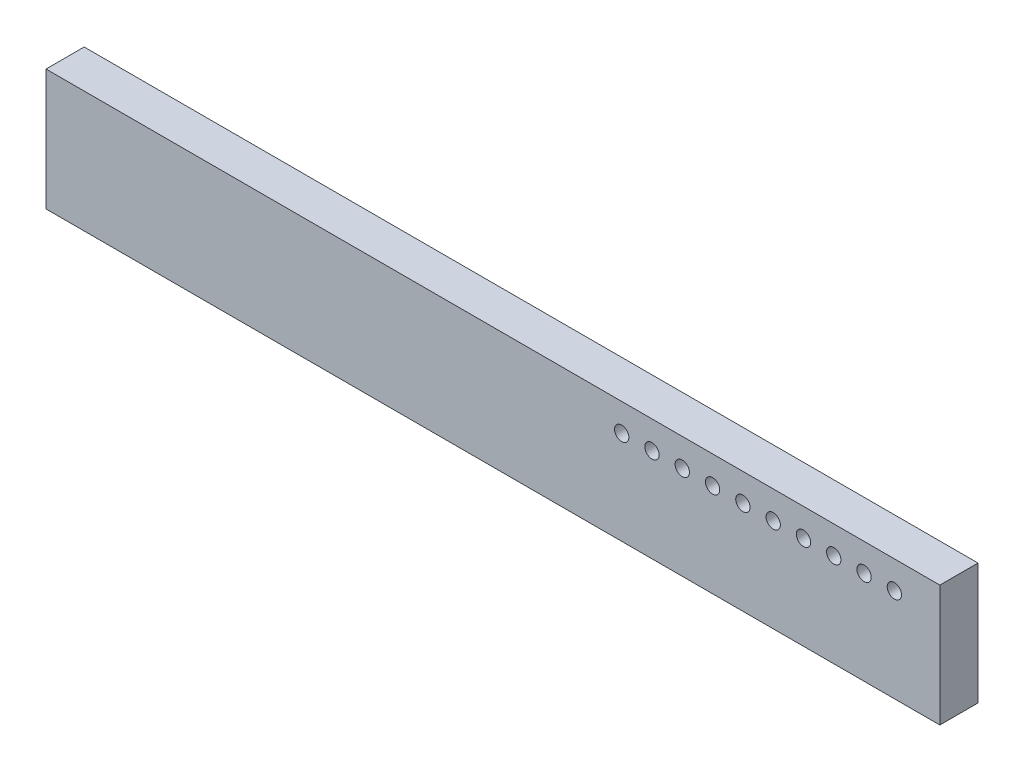
ISO-10303-21;
HEADER;
FILE_DESCRIPTION(('STEP AP214'),'2;1');
FILE_NAME('part.step','',(''),(''),'','','');
FILE_SCHEMA(('AUTOMOTIVE_DESIGN { 1 0 10303 214 1 1 1 1 }'));
ENDSEC;
DATA;
#1=APPLICATION_CONTEXT('core data for automotive mechanical design processes');
#2=APPLICATION_PROTOCOL_DEFINITION('international standard','automotive_design',2000,#1);
#3=PRODUCT_CONTEXT('',#1,'mechanical');
#4=PRODUCT('Part','Part','',(#3));
#5=PRODUCT_RELATED_PRODUCT_CATEGORY('part','',(#4));
#6=PRODUCT_DEFINITION_FORMATION('','',#4);
#7=PRODUCT_DEFINITION_CONTEXT('part definition',#1,'design');
#8=PRODUCT_DEFINITION('design','',#6,#7);
#9=PRODUCT_DEFINITION_SHAPE('','',#8);
#10=(LENGTH_UNIT() NAMED_UNIT(*) SI_UNIT(.MILLI.,.METRE.));
#11=(NAMED_UNIT(*) PLANE_ANGLE_UNIT() SI_UNIT($,.RADIAN.));
#12=(NAMED_UNIT(*) SI_UNIT($,.STERADIAN.) SOLID_ANGLE_UNIT());
#13=UNCERTAINTY_MEASURE_WITH_UNIT(LENGTH_MEASURE(1.E-05),#10,'distance_accuracy_value','');
#14=(GEOMETRIC_REPRESENTATION_CONTEXT(3) GLOBAL_UNCERTAINTY_ASSIGNED_CONTEXT((#13)) GLOBAL_UNIT_ASSIGNED_CONTEXT((#10,
#11,#12)) REPRESENTATION_CONTEXT('',''));
#15=CARTESIAN_POINT('',(0.,0.,0.));
#16=DIRECTION('',(0.,0.,1.));
#17=DIRECTION('',(1.,0.,0.));
#18=AXIS2_PLACEMENT_3D('',#15,#16,#17);
#19=CARTESIAN_POINT('',(-18.7325,2.54,1.6));
#20=DIRECTION('',(0.,1.,0.));
#21=DIRECTION('',(0.,0.,1.));
#22=AXIS2_PLACEMENT_3D('',#19,#20,#21);
#23=PLANE('',#22);
#24=DIRECTION('',(1.,0.,0.));
#25=VECTOR('',#24,1.);
#26=CARTESIAN_POINT('',(-18.7325,2.54,0.));
#27=LINE('',#26,#25);
#28=CARTESIAN_POINT('',(-18.7325,2.54,0.));
#29=VERTEX_POINT('',#28);
#30=CARTESIAN_POINT('',(18.7325,2.54,0.));
#31=VERTEX_POINT('',#30);
#32=EDGE_CURVE('E86',#29,#31,#27,.T.);
#33=ORIENTED_EDGE('',*,*,#32,.F.);
#34=DIRECTION('',(0.,0.,-1.));
#35=VECTOR('',#34,1.);
#36=CARTESIAN_POINT('',(-18.7325,2.54,1.6));
#37=LINE('',#36,#35);
#38=CARTESIAN_POINT('',(-18.7325,2.54,1.6));
#39=VERTEX_POINT('',#38);
#40=EDGE_CURVE('E75',#39,#29,#37,.T.);
#41=ORIENTED_EDGE('',*,*,#40,.F.);
#42=DIRECTION('',(1.,0.,0.));
#43=VECTOR('',#42,1.);
#44=CARTESIAN_POINT('',(-18.7325,2.54,1.6));
#45=LINE('',#44,#43);
#46=CARTESIAN_POINT('',(18.7325,2.54,1.6));
#47=VERTEX_POINT('',#46);
#48=EDGE_CURVE('E110',#39,#47,#45,.T.);
#49=ORIENTED_EDGE('',*,*,#48,.T.);
#50=DIRECTION('',(0.,0.,-1.));
#51=VECTOR('',#50,1.);
#52=CARTESIAN_POINT('',(18.7325,2.54,1.6));
#53=LINE('',#52,#51);
#54=EDGE_CURVE('E87',#47,#31,#53,.T.);
#55=ORIENTED_EDGE('',*,*,#54,.T.);
#56=EDGE_LOOP('',(#33,#41,#49,#55));
#57=FACE_BOUND('',#56,.T.);
#58=ADVANCED_FACE('F32',(#57),#23,.T.);
#59=CARTESIAN_POINT('',(-18.7325,-2.54,1.6));
#60=DIRECTION('',(-1.,0.,0.));
#61=DIRECTION('',(0.,0.,1.));
#62=AXIS2_PLACEMENT_3D('',#59,#60,#61);
#63=PLANE('',#62);
#64=DIRECTION('',(0.,1.,0.));
#65=VECTOR('',#64,1.);
#66=CARTESIAN_POINT('',(-18.7325,-2.54,0.));
#67=LINE('',#66,#65);
#68=CARTESIAN_POINT('',(-18.7325,-2.54,0.));
#69=VERTEX_POINT('',#68);
#70=EDGE_CURVE('E79',#69,#29,#67,.T.);
#71=ORIENTED_EDGE('',*,*,#70,.F.);
#72=DIRECTION('',(0.,0.,-1.));
#73=VECTOR('',#72,1.);
#74=CARTESIAN_POINT('',(-18.7325,-2.54,1.6));
#75=LINE('',#74,#73);
#76=CARTESIAN_POINT('',(-18.7325,-2.54,1.6));
#77=VERTEX_POINT('',#76);
#78=EDGE_CURVE('E103',#77,#69,#75,.T.);
#79=ORIENTED_EDGE('',*,*,#78,.F.);
#80=DIRECTION('',(0.,1.,0.));
#81=VECTOR('',#80,1.);
#82=CARTESIAN_POINT('',(-18.7325,-2.54,1.6));
#83=LINE('',#82,#81);
#84=EDGE_CURVE('E80',#77,#39,#83,.T.);
#85=ORIENTED_EDGE('',*,*,#84,.T.);
#86=ORIENTED_EDGE('',*,*,#40,.T.);
#87=EDGE_LOOP('',(#71,#79,#85,#86));
#88=FACE_BOUND('',#87,.T.);
#89=ADVANCED_FACE('F77',(#88),#63,.T.);
#90=CARTESIAN_POINT('',(-18.7325,-2.54,1.6));
#91=DIRECTION('',(0.,1.,0.));
#92=DIRECTION('',(0.,0.,1.));
#93=AXIS2_PLACEMENT_3D('',#90,#91,#92);
#94=PLANE('',#93);
#95=DIRECTION('',(1.,0.,0.));
#96=VECTOR('',#95,1.);
#97=CARTESIAN_POINT('',(-18.7325,-2.54,0.));
#98=LINE('',#97,#96);
#99=CARTESIAN_POINT('',(18.7325,-2.54,0.));
#100=VERTEX_POINT('',#99);
#101=EDGE_CURVE('E83',#69,#100,#98,.T.);
#102=ORIENTED_EDGE('',*,*,#101,.T.);
#103=DIRECTION('',(0.,0.,-1.));
#104=VECTOR('',#103,1.);
#105=CARTESIAN_POINT('',(18.7325,-2.54,1.6));
#106=LINE('',#105,#104);
#107=CARTESIAN_POINT('',(18.7325,-2.54,1.6));
#108=VERTEX_POINT('',#107);
#109=EDGE_CURVE('E105',#108,#100,#106,.T.);
#110=ORIENTED_EDGE('',*,*,#109,.F.);
#111=DIRECTION('',(1.,0.,0.));
#112=VECTOR('',#111,1.);
#113=CARTESIAN_POINT('',(-18.7325,-2.54,1.6));
#114=LINE('',#113,#112);
#115=EDGE_CURVE('E53',#77,#108,#114,.T.);
#116=ORIENTED_EDGE('',*,*,#115,.F.);
#117=ORIENTED_EDGE('',*,*,#78,.T.);
#118=EDGE_LOOP('',(#102,#110,#116,#117));
#119=FACE_BOUND('',#118,.T.);
#120=ADVANCED_FACE('F212',(#119),#94,.F.);
#121=CARTESIAN_POINT('',(18.7325,-2.54,1.6));
#122=DIRECTION('',(-1.,0.,0.));
#123=DIRECTION('',(0.,0.,1.));
#124=AXIS2_PLACEMENT_3D('',#121,#122,#123);
#125=PLANE('',#124);
#126=DIRECTION('',(0.,1.,0.));
#127=VECTOR('',#126,1.);
#128=CARTESIAN_POINT('',(18.7325,-2.54,0.));
#129=LINE('',#128,#127);
#130=EDGE_CURVE('E104',#100,#31,#129,.T.);
#131=ORIENTED_EDGE('',*,*,#130,.T.);
#132=ORIENTED_EDGE('',*,*,#54,.F.);
#133=DIRECTION('',(0.,1.,0.));
#134=VECTOR('',#133,1.);
#135=CARTESIAN_POINT('',(18.7325,-2.54,1.6));
#136=LINE('',#135,#134);
#137=EDGE_CURVE('E48',#108,#47,#136,.T.);
#138=ORIENTED_EDGE('',*,*,#137,.F.);
#139=ORIENTED_EDGE('',*,*,#109,.T.);
#140=EDGE_LOOP('',(#131,#132,#138,#139));
#141=FACE_BOUND('',#140,.T.);
#142=ADVANCED_FACE('F174',(#141),#125,.F.);
#143=CARTESIAN_POINT('',(0.,0.,1.6));
#144=DIRECTION('',(0.,0.,1.));
#145=DIRECTION('',(1.,0.,0.));
#146=AXIS2_PLACEMENT_3D('',#143,#144,#145);
#147=PLANE('',#146);
#148=CARTESIAN_POINT('',(16.8275000000017,1.38,1.6));
#149=DIRECTION('',(0.,0.,1.));
#150=DIRECTION('',(1.,0.,0.));
#151=AXIS2_PLACEMENT_3D('',#148,#149,#150);
#152=CIRCLE('',#151,0.3);
#153=CARTESIAN_POINT('',(17.1275000000017,1.38,1.6));
#154=VERTEX_POINT('',#153);
#155=EDGE_CURVE('E11',#154,#154,#152,.T.);
#156=ORIENTED_EDGE('',*,*,#155,.F.);
#157=EDGE_LOOP('',(#156));
#158=FACE_BOUND('',#157,.T.);
#159=CARTESIAN_POINT('',(15.5575000000017,1.37999999999999,1.6));
#160=DIRECTION('',(0.,0.,1.));
#161=DIRECTION('',(1.,0.,0.));
#162=AXIS2_PLACEMENT_3D('',#159,#160,#161);
#163=CIRCLE('',#162,0.3);
#164=CARTESIAN_POINT('',(15.8575000000017,1.37999999999999,1.6));
#165=VERTEX_POINT('',#164);
#166=EDGE_CURVE('E41',#165,#165,#163,.T.);
#167=ORIENTED_EDGE('',*,*,#166,.F.);
#168=EDGE_LOOP('',(#167));
#169=FACE_BOUND('',#168,.T.);
#170=CARTESIAN_POINT('',(14.2875000000017,1.37999999999998,1.6));
#171=DIRECTION('',(0.,0.,1.));
#172=DIRECTION('',(1.,0.,0.));
#173=AXIS2_PLACEMENT_3D('',#170,#171,#172);
#174=CIRCLE('',#173,0.3);
#175=CARTESIAN_POINT('',(14.5875000000017,1.37999999999998,1.6));
#176=VERTEX_POINT('',#175);
#177=EDGE_CURVE('E147',#176,#176,#174,.T.);
#178=ORIENTED_EDGE('',*,*,#177,.F.);
#179=EDGE_LOOP('',(#178));
#180=FACE_BOUND('',#179,.T.);
#181=CARTESIAN_POINT('',(13.0175000000017,1.37999999999997,1.6));
#182=DIRECTION('',(0.,0.,1.));
#183=DIRECTION('',(1.,0.,0.));
#184=AXIS2_PLACEMENT_3D('',#181,#182,#183);
#185=CIRCLE('',#184,0.3);
#186=CARTESIAN_POINT('',(13.3175000000017,1.37999999999997,1.6));
#187=VERTEX_POINT('',#186);
#188=EDGE_CURVE('E141',#187,#187,#185,.T.);
#189=ORIENTED_EDGE('',*,*,#188,.F.);
#190=EDGE_LOOP('',(#189));
#191=FACE_BOUND('',#190,.T.);
#192=CARTESIAN_POINT('',(11.7475000000017,1.37999999999997,1.6));
#193=DIRECTION('',(0.,0.,1.));
#194=DIRECTION('',(1.,0.,0.));
#195=AXIS2_PLACEMENT_3D('',#192,#193,#194);
#196=CIRCLE('',#195,0.3);
#197=CARTESIAN_POINT('',(12.0475000000017,1.37999999999997,1.6));
#198=VERTEX_POINT('',#197);
#199=EDGE_CURVE('E135',#198,#198,#196,.T.);
#200=ORIENTED_EDGE('',*,*,#199,.F.);
#201=EDGE_LOOP('',(#200));
#202=FACE_BOUND('',#201,.T.);
#203=CARTESIAN_POINT('',(10.4775000000017,1.37999999999996,1.6));
#204=DIRECTION('',(0.,0.,1.));
#205=DIRECTION('',(1.,0.,0.));
#206=AXIS2_PLACEMENT_3D('',#203,#204,#205);
#207=CIRCLE('',#206,0.3);
#208=CARTESIAN_POINT('',(10.7775000000017,1.37999999999996,1.6));
#209=VERTEX_POINT('',#208);
#210=EDGE_CURVE('E129',#209,#209,#207,.T.);
#211=ORIENTED_EDGE('',*,*,#210,.F.);
#212=EDGE_LOOP('',(#211));
#213=FACE_BOUND('',#212,.T.);
#214=CARTESIAN_POINT('',(9.20750000000171,1.37999999999995,1.6));
#215=DIRECTION('',(0.,0.,1.));
#216=DIRECTION('',(1.,0.,0.));
#217=AXIS2_PLACEMENT_3D('',#214,#215,#216);
#218=CIRCLE('',#217,0.3);
#219=CARTESIAN_POINT('',(9.50750000000171,1.37999999999995,1.6));
#220=VERTEX_POINT('',#219);
#221=EDGE_CURVE('E123',#220,#220,#218,.T.);
#222=ORIENTED_EDGE('',*,*,#221,.F.);
#223=EDGE_LOOP('',(#222));
#224=FACE_BOUND('',#223,.T.);
#225=CARTESIAN_POINT('',(7.93750000000171,1.37999999999994,1.6));
#226=DIRECTION('',(0.,0.,1.));
#227=DIRECTION('',(1.,0.,0.));
#228=AXIS2_PLACEMENT_3D('',#225,#226,#227);
#229=CIRCLE('',#228,0.3);
#230=CARTESIAN_POINT('',(8.23750000000171,1.37999999999994,1.6));
#231=VERTEX_POINT('',#230);
#232=EDGE_CURVE('E117',#231,#231,#229,.T.);
#233=ORIENTED_EDGE('',*,*,#232,.F.);
#234=EDGE_LOOP('',(#233));
#235=FACE_BOUND('',#234,.T.);
#236=CARTESIAN_POINT('',(6.66750000000171,1.37999999999993,1.6));
#237=DIRECTION('',(0.,0.,1.));
#238=DIRECTION('',(1.,0.,0.));
#239=AXIS2_PLACEMENT_3D('',#236,#237,#238);
#240=CIRCLE('',#239,0.3);
#241=CARTESIAN_POINT('',(6.96750000000171,1.37999999999993,1.6));
#242=VERTEX_POINT('',#241);
#243=EDGE_CURVE('E98',#242,#242,#240,.T.);
#244=ORIENTED_EDGE('',*,*,#243,.F.);
#245=EDGE_LOOP('',(#244));
#246=FACE_BOUND('',#245,.T.);
#247=CARTESIAN_POINT('',(5.39750000000171,1.37999999999992,1.6));
#248=DIRECTION('',(0.,0.,1.));
#249=DIRECTION('',(1.,0.,0.));
#250=AXIS2_PLACEMENT_3D('',#247,#248,#249);
#251=CIRCLE('',#250,0.3);
#252=CARTESIAN_POINT('',(5.69750000000171,1.37999999999992,1.6));
#253=VERTEX_POINT('',#252);
#254=EDGE_CURVE('E95',#253,#253,#251,.T.);
#255=ORIENTED_EDGE('',*,*,#254,.F.);
#256=EDGE_LOOP('',(#255));
#257=FACE_BOUND('',#256,.T.);
#258=ORIENTED_EDGE('',*,*,#48,.F.);
#259=ORIENTED_EDGE('',*,*,#84,.F.);
#260=ORIENTED_EDGE('',*,*,#115,.T.);
#261=ORIENTED_EDGE('',*,*,#137,.T.);
#262=EDGE_LOOP('',(#258,#259,#260,#261));
#263=FACE_BOUND('',#262,.T.);
#264=ADVANCED_FACE('F34',(#158,#169,#180,#191,#202,#213,#224,#235,#246,#257,#263),#147,.T.);
#265=CARTESIAN_POINT('',(0.,0.,0.));
#266=DIRECTION('',(0.,0.,1.));
#267=DIRECTION('',(1.,0.,0.));
#268=AXIS2_PLACEMENT_3D('',#265,#266,#267);
#269=PLANE('',#268);
#270=CARTESIAN_POINT('',(16.8275000000017,1.38,0.));
#271=DIRECTION('',(0.,0.,1.));
#272=DIRECTION('',(1.,0.,0.));
#273=AXIS2_PLACEMENT_3D('',#270,#271,#272);
#274=CIRCLE('',#273,0.3);
#275=CARTESIAN_POINT('',(17.1275000000017,1.38,0.));
#276=VERTEX_POINT('',#275);
#277=EDGE_CURVE('E36',#276,#276,#274,.T.);
#278=ORIENTED_EDGE('',*,*,#277,.T.);
#279=EDGE_LOOP('',(#278));
#280=FACE_BOUND('',#279,.T.);
#281=CARTESIAN_POINT('',(15.5575000000017,1.37999999999999,0.));
#282=DIRECTION('',(0.,0.,1.));
#283=DIRECTION('',(1.,0.,0.));
#284=AXIS2_PLACEMENT_3D('',#281,#282,#283);
#285=CIRCLE('',#284,0.3);
#286=CARTESIAN_POINT('',(15.8575000000017,1.37999999999999,0.));
#287=VERTEX_POINT('',#286);
#288=EDGE_CURVE('E155',#287,#287,#285,.T.);
#289=ORIENTED_EDGE('',*,*,#288,.T.);
#290=EDGE_LOOP('',(#289));
#291=FACE_BOUND('',#290,.T.);
#292=CARTESIAN_POINT('',(14.2875000000017,1.37999999999998,0.));
#293=DIRECTION('',(0.,0.,1.));
#294=DIRECTION('',(1.,0.,0.));
#295=AXIS2_PLACEMENT_3D('',#292,#293,#294);
#296=CIRCLE('',#295,0.3);
#297=CARTESIAN_POINT('',(14.5875000000017,1.37999999999998,0.));
#298=VERTEX_POINT('',#297);
#299=EDGE_CURVE('E150',#298,#298,#296,.T.);
#300=ORIENTED_EDGE('',*,*,#299,.T.);
#301=EDGE_LOOP('',(#300));
#302=FACE_BOUND('',#301,.T.);
#303=CARTESIAN_POINT('',(13.0175000000017,1.37999999999997,0.));
#304=DIRECTION('',(0.,0.,1.));
#305=DIRECTION('',(1.,0.,0.));
#306=AXIS2_PLACEMENT_3D('',#303,#304,#305);
#307=CIRCLE('',#306,0.3);
#308=CARTESIAN_POINT('',(13.3175000000017,1.37999999999997,0.));
#309=VERTEX_POINT('',#308);
#310=EDGE_CURVE('E144',#309,#309,#307,.T.);
#311=ORIENTED_EDGE('',*,*,#310,.T.);
#312=EDGE_LOOP('',(#311));
#313=FACE_BOUND('',#312,.T.);
#314=CARTESIAN_POINT('',(11.7475000000017,1.37999999999997,0.));
#315=DIRECTION('',(0.,0.,1.));
#316=DIRECTION('',(1.,0.,0.));
#317=AXIS2_PLACEMENT_3D('',#314,#315,#316);
#318=CIRCLE('',#317,0.3);
#319=CARTESIAN_POINT('',(12.0475000000017,1.37999999999997,0.));
#320=VERTEX_POINT('',#319);
#321=EDGE_CURVE('E138',#320,#320,#318,.T.);
#322=ORIENTED_EDGE('',*,*,#321,.T.);
#323=EDGE_LOOP('',(#322));
#324=FACE_BOUND('',#323,.T.);
#325=CARTESIAN_POINT('',(10.4775000000017,1.37999999999996,0.));
#326=DIRECTION('',(0.,0.,1.));
#327=DIRECTION('',(1.,0.,0.));
#328=AXIS2_PLACEMENT_3D('',#325,#326,#327);
#329=CIRCLE('',#328,0.3);
#330=CARTESIAN_POINT('',(10.7775000000017,1.37999999999996,0.));
#331=VERTEX_POINT('',#330);
#332=EDGE_CURVE('E132',#331,#331,#329,.T.);
#333=ORIENTED_EDGE('',*,*,#332,.T.);
#334=EDGE_LOOP('',(#333));
#335=FACE_BOUND('',#334,.T.);
#336=CARTESIAN_POINT('',(9.20750000000171,1.37999999999995,0.));
#337=DIRECTION('',(0.,0.,1.));
#338=DIRECTION('',(1.,0.,0.));
#339=AXIS2_PLACEMENT_3D('',#336,#337,#338);
#340=CIRCLE('',#339,0.3);
#341=CARTESIAN_POINT('',(9.50750000000171,1.37999999999995,0.));
#342=VERTEX_POINT('',#341);
#343=EDGE_CURVE('E126',#342,#342,#340,.T.);
#344=ORIENTED_EDGE('',*,*,#343,.T.);
#345=EDGE_LOOP('',(#344));
#346=FACE_BOUND('',#345,.T.);
#347=CARTESIAN_POINT('',(7.93750000000171,1.37999999999994,0.));
#348=DIRECTION('',(0.,0.,1.));
#349=DIRECTION('',(1.,0.,0.));
#350=AXIS2_PLACEMENT_3D('',#347,#348,#349);
#351=CIRCLE('',#350,0.3);
#352=CARTESIAN_POINT('',(8.23750000000171,1.37999999999994,0.));
#353=VERTEX_POINT('',#352);
#354=EDGE_CURVE('E120',#353,#353,#351,.T.);
#355=ORIENTED_EDGE('',*,*,#354,.T.);
#356=EDGE_LOOP('',(#355));
#357=FACE_BOUND('',#356,.T.);
#358=CARTESIAN_POINT('',(6.66750000000171,1.37999999999993,0.));
#359=DIRECTION('',(0.,0.,1.));
#360=DIRECTION('',(1.,0.,0.));
#361=AXIS2_PLACEMENT_3D('',#358,#359,#360);
#362=CIRCLE('',#361,0.3);
#363=CARTESIAN_POINT('',(6.96750000000171,1.37999999999993,0.));
#364=VERTEX_POINT('',#363);
#365=EDGE_CURVE('E114',#364,#364,#362,.T.);
#366=ORIENTED_EDGE('',*,*,#365,.T.);
#367=EDGE_LOOP('',(#366));
#368=FACE_BOUND('',#367,.T.);
#369=CARTESIAN_POINT('',(5.39750000000171,1.37999999999992,0.));
#370=DIRECTION('',(0.,0.,1.));
#371=DIRECTION('',(1.,0.,0.));
#372=AXIS2_PLACEMENT_3D('',#369,#370,#371);
#373=CIRCLE('',#372,0.3);
#374=CARTESIAN_POINT('',(5.69750000000171,1.37999999999992,0.));
#375=VERTEX_POINT('',#374);
#376=EDGE_CURVE('E91',#375,#375,#373,.T.);
#377=ORIENTED_EDGE('',*,*,#376,.T.);
#378=EDGE_LOOP('',(#377));
#379=FACE_BOUND('',#378,.T.);
#380=ORIENTED_EDGE('',*,*,#32,.T.);
#381=ORIENTED_EDGE('',*,*,#130,.F.);
#382=ORIENTED_EDGE('',*,*,#101,.F.);
#383=ORIENTED_EDGE('',*,*,#70,.T.);
#384=EDGE_LOOP('',(#380,#381,#382,#383));
#385=FACE_BOUND('',#384,.T.);
#386=ADVANCED_FACE('F94',(#280,#291,#302,#313,#324,#335,#346,#357,#368,#379,#385),#269,.F.);
#387=CARTESIAN_POINT('',(5.39750000000171,1.37999999999992,0.));
#388=DIRECTION('',(0.,0.,1.));
#389=DIRECTION('',(1.,0.,0.));
#390=AXIS2_PLACEMENT_3D('',#387,#388,#389);
#391=CYLINDRICAL_SURFACE('',#390,0.3);
#392=ORIENTED_EDGE('',*,*,#376,.F.);
#393=EDGE_LOOP('',(#392));
#394=FACE_BOUND('',#393,.T.);
#395=ORIENTED_EDGE('',*,*,#254,.T.);
#396=EDGE_LOOP('',(#395));
#397=FACE_BOUND('',#396,.T.);
#398=ADVANCED_FACE('F193',(#394,#397),#391,.F.);
#399=CARTESIAN_POINT('',(6.66750000000171,1.37999999999993,0.));
#400=DIRECTION('',(0.,0.,1.));
#401=DIRECTION('',(1.,0.,0.));
#402=AXIS2_PLACEMENT_3D('',#399,#400,#401);
#403=CYLINDRICAL_SURFACE('',#402,0.3);
#404=ORIENTED_EDGE('',*,*,#365,.F.);
#405=EDGE_LOOP('',(#404));
#406=FACE_BOUND('',#405,.T.);
#407=ORIENTED_EDGE('',*,*,#243,.T.);
#408=EDGE_LOOP('',(#407));
#409=FACE_BOUND('',#408,.T.);
#410=ADVANCED_FACE('F195',(#406,#409),#403,.F.);
#411=CARTESIAN_POINT('',(7.93750000000171,1.37999999999994,0.));
#412=DIRECTION('',(0.,0.,1.));
#413=DIRECTION('',(1.,0.,0.));
#414=AXIS2_PLACEMENT_3D('',#411,#412,#413);
#415=CYLINDRICAL_SURFACE('',#414,0.3);
#416=ORIENTED_EDGE('',*,*,#354,.F.);
#417=EDGE_LOOP('',(#416));
#418=FACE_BOUND('',#417,.T.);
#419=ORIENTED_EDGE('',*,*,#232,.T.);
#420=EDGE_LOOP('',(#419));
#421=FACE_BOUND('',#420,.T.);
#422=ADVANCED_FACE('F202',(#418,#421),#415,.F.);
#423=CARTESIAN_POINT('',(9.20750000000171,1.37999999999995,0.));
#424=DIRECTION('',(0.,0.,1.));
#425=DIRECTION('',(1.,0.,0.));
#426=AXIS2_PLACEMENT_3D('',#423,#424,#425);
#427=CYLINDRICAL_SURFACE('',#426,0.3);
#428=ORIENTED_EDGE('',*,*,#343,.F.);
#429=EDGE_LOOP('',(#428));
#430=FACE_BOUND('',#429,.T.);
#431=ORIENTED_EDGE('',*,*,#221,.T.);
#432=EDGE_LOOP('',(#431));
#433=FACE_BOUND('',#432,.T.);
#434=ADVANCED_FACE('F257',(#430,#433),#427,.F.);
#435=CARTESIAN_POINT('',(10.4775000000017,1.37999999999996,0.));
#436=DIRECTION('',(0.,0.,1.));
#437=DIRECTION('',(1.,0.,0.));
#438=AXIS2_PLACEMENT_3D('',#435,#436,#437);
#439=CYLINDRICAL_SURFACE('',#438,0.3);
#440=ORIENTED_EDGE('',*,*,#332,.F.);
#441=EDGE_LOOP('',(#440));
#442=FACE_BOUND('',#441,.T.);
#443=ORIENTED_EDGE('',*,*,#210,.T.);
#444=EDGE_LOOP('',(#443));
#445=FACE_BOUND('',#444,.T.);
#446=ADVANCED_FACE('F267',(#442,#445),#439,.F.);
#447=CARTESIAN_POINT('',(11.7475000000017,1.37999999999997,0.));
#448=DIRECTION('',(0.,0.,1.));
#449=DIRECTION('',(1.,0.,0.));
#450=AXIS2_PLACEMENT_3D('',#447,#448,#449);
#451=CYLINDRICAL_SURFACE('',#450,0.3);
#452=ORIENTED_EDGE('',*,*,#321,.F.);
#453=EDGE_LOOP('',(#452));
#454=FACE_BOUND('',#453,.T.);
#455=ORIENTED_EDGE('',*,*,#199,.T.);
#456=EDGE_LOOP('',(#455));
#457=FACE_BOUND('',#456,.T.);
#458=ADVANCED_FACE('F277',(#454,#457),#451,.F.);
#459=CARTESIAN_POINT('',(13.0175000000017,1.37999999999997,0.));
#460=DIRECTION('',(0.,0.,1.));
#461=DIRECTION('',(1.,0.,0.));
#462=AXIS2_PLACEMENT_3D('',#459,#460,#461);
#463=CYLINDRICAL_SURFACE('',#462,0.3);
#464=ORIENTED_EDGE('',*,*,#310,.F.);
#465=EDGE_LOOP('',(#464));
#466=FACE_BOUND('',#465,.T.);
#467=ORIENTED_EDGE('',*,*,#188,.T.);
#468=EDGE_LOOP('',(#467));
#469=FACE_BOUND('',#468,.T.);
#470=ADVANCED_FACE('F287',(#466,#469),#463,.F.);
#471=CARTESIAN_POINT('',(14.2875000000017,1.37999999999998,0.));
#472=DIRECTION('',(0.,0.,1.));
#473=DIRECTION('',(1.,0.,0.));
#474=AXIS2_PLACEMENT_3D('',#471,#472,#473);
#475=CYLINDRICAL_SURFACE('',#474,0.3);
#476=ORIENTED_EDGE('',*,*,#299,.F.);
#477=EDGE_LOOP('',(#476));
#478=FACE_BOUND('',#477,.T.);
#479=ORIENTED_EDGE('',*,*,#177,.T.);
#480=EDGE_LOOP('',(#479));
#481=FACE_BOUND('',#480,.T.);
#482=ADVANCED_FACE('F297',(#478,#481),#475,.F.);
#483=CARTESIAN_POINT('',(15.5575000000017,1.37999999999999,0.));
#484=DIRECTION('',(0.,0.,1.));
#485=DIRECTION('',(1.,0.,0.));
#486=AXIS2_PLACEMENT_3D('',#483,#484,#485);
#487=CYLINDRICAL_SURFACE('',#486,0.3);
#488=ORIENTED_EDGE('',*,*,#288,.F.);
#489=EDGE_LOOP('',(#488));
#490=FACE_BOUND('',#489,.T.);
#491=ORIENTED_EDGE('',*,*,#166,.T.);
#492=EDGE_LOOP('',(#491));
#493=FACE_BOUND('',#492,.T.);
#494=ADVANCED_FACE('F168',(#490,#493),#487,.F.);
#495=CARTESIAN_POINT('',(16.8275000000017,1.38,0.));
#496=DIRECTION('',(0.,0.,1.));
#497=DIRECTION('',(1.,0.,0.));
#498=AXIS2_PLACEMENT_3D('',#495,#496,#497);
#499=CYLINDRICAL_SURFACE('',#498,0.3);
#500=ORIENTED_EDGE('',*,*,#277,.F.);
#501=EDGE_LOOP('',(#500));
#502=FACE_BOUND('',#501,.T.);
#503=ORIENTED_EDGE('',*,*,#155,.T.);
#504=EDGE_LOOP('',(#503));
#505=FACE_BOUND('',#504,.T.);
#506=ADVANCED_FACE('F165',(#502,#505),#499,.F.);
#507=CLOSED_SHELL('',(#58,#89,#120,#142,#264,#386,#398,#410,#422,#434,#446,#458,#470,#482,#494,#506));
#508=MANIFOLD_SOLID_BREP('B2',#507);
#509=ADVANCED_BREP_SHAPE_REPRESENTATION('',(#18,#508),#14);
#510=SHAPE_DEFINITION_REPRESENTATION(#9,#509);
ENDSEC;
END-ISO-10303-21;
